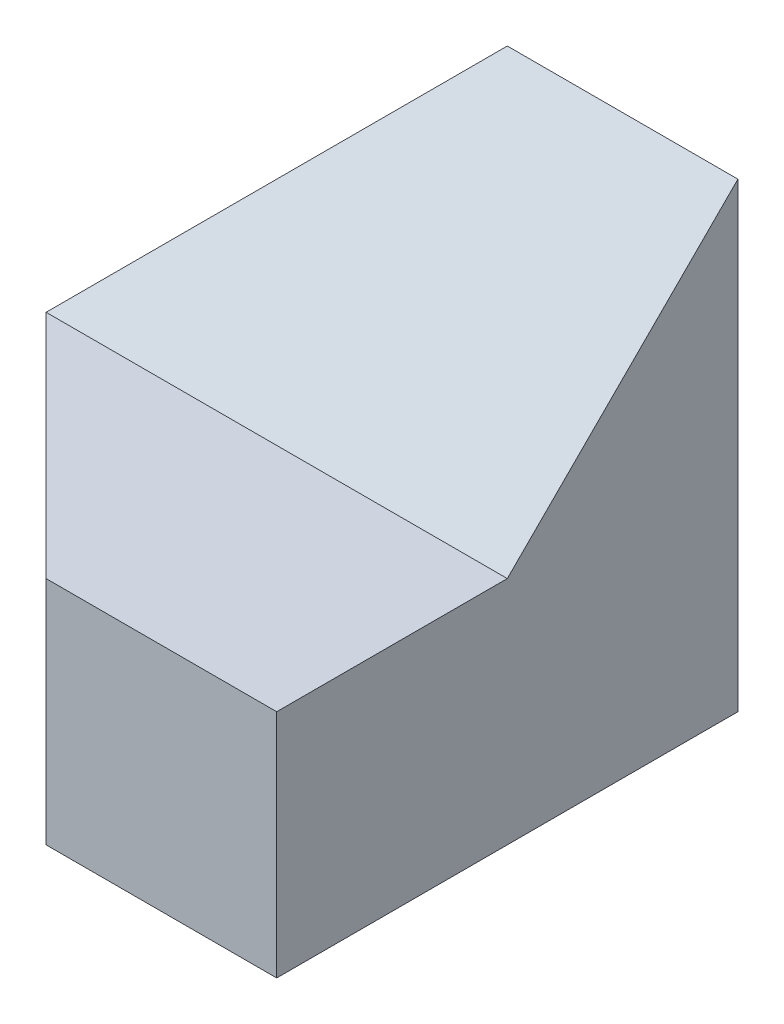
ISO-10303-21;
HEADER;
FILE_DESCRIPTION(('STEP AP214'),'2;1');
FILE_NAME('part.step','',(''),(''),'','','');
FILE_SCHEMA(('AUTOMOTIVE_DESIGN { 1 0 10303 214 1 1 1 1 }'));
ENDSEC;
DATA;
#1=APPLICATION_CONTEXT('core data for automotive mechanical design processes');
#2=APPLICATION_PROTOCOL_DEFINITION('international standard','automotive_design',2000,#1);
#3=PRODUCT_CONTEXT('',#1,'mechanical');
#4=PRODUCT('Part','Part','',(#3));
#5=PRODUCT_RELATED_PRODUCT_CATEGORY('part','',(#4));
#6=PRODUCT_DEFINITION_FORMATION('','',#4);
#7=PRODUCT_DEFINITION_CONTEXT('part definition',#1,'design');
#8=PRODUCT_DEFINITION('design','',#6,#7);
#9=PRODUCT_DEFINITION_SHAPE('','',#8);
#10=(LENGTH_UNIT() NAMED_UNIT(*) SI_UNIT(.MILLI.,.METRE.));
#11=(NAMED_UNIT(*) PLANE_ANGLE_UNIT() SI_UNIT($,.RADIAN.));
#12=(NAMED_UNIT(*) SI_UNIT($,.STERADIAN.) SOLID_ANGLE_UNIT());
#13=UNCERTAINTY_MEASURE_WITH_UNIT(LENGTH_MEASURE(1.E-05),#10,'distance_accuracy_value','');
#14=(GEOMETRIC_REPRESENTATION_CONTEXT(3) GLOBAL_UNCERTAINTY_ASSIGNED_CONTEXT((#13)) GLOBAL_UNIT_ASSIGNED_CONTEXT((#10,
#11,#12)) REPRESENTATION_CONTEXT('',''));
#15=CARTESIAN_POINT('',(0.,0.,0.));
#16=DIRECTION('',(0.,0.,1.));
#17=DIRECTION('',(1.,0.,0.));
#18=AXIS2_PLACEMENT_3D('',#15,#16,#17);
#19=CARTESIAN_POINT('',(0.,0.,40.));
#20=DIRECTION('',(1.,0.,0.));
#21=DIRECTION('',(0.,0.,-1.));
#22=AXIS2_PLACEMENT_3D('',#19,#20,#21);
#23=PLANE('',#22);
#24=DIRECTION('',(0.,0.,-1.));
#25=VECTOR('',#24,1.);
#26=CARTESIAN_POINT('',(0.,0.,40.));
#27=LINE('',#26,#25);
#28=CARTESIAN_POINT('',(0.,0.,20.));
#29=VERTEX_POINT('',#28);
#30=CARTESIAN_POINT('',(0.,0.,0.));
#31=VERTEX_POINT('',#30);
#32=EDGE_CURVE('E40',#29,#31,#27,.T.);
#33=ORIENTED_EDGE('',*,*,#32,.F.);
#34=DIRECTION('',(0.,1.,0.));
#35=VECTOR('',#34,1.);
#36=CARTESIAN_POINT('',(0.,-20.,20.));
#37=LINE('',#36,#35);
#38=CARTESIAN_POINT('',(0.,20.,20.));
#39=VERTEX_POINT('',#38);
#40=EDGE_CURVE('E99',#29,#39,#37,.T.);
#41=ORIENTED_EDGE('',*,*,#40,.T.);
#42=DIRECTION('',(0.,0.,1.));
#43=VECTOR('',#42,1.);
#44=CARTESIAN_POINT('',(0.,20.,0.));
#45=LINE('',#44,#43);
#46=CARTESIAN_POINT('',(0.,20.,0.));
#47=VERTEX_POINT('',#46);
#48=EDGE_CURVE('E105',#47,#39,#45,.T.);
#49=ORIENTED_EDGE('',*,*,#48,.F.);
#50=DIRECTION('',(0.,-1.,0.));
#51=VECTOR('',#50,1.);
#52=CARTESIAN_POINT('',(0.,0.,0.));
#53=LINE('',#52,#51);
#54=EDGE_CURVE('E119',#47,#31,#53,.T.);
#55=ORIENTED_EDGE('',*,*,#54,.T.);
#56=EDGE_LOOP('',(#33,#41,#49,#55));
#57=FACE_BOUND('',#56,.T.);
#58=ADVANCED_FACE('F33',(#57),#23,.F.);
#59=CARTESIAN_POINT('',(0.,0.,40.));
#60=DIRECTION('',(0.,1.,0.));
#61=DIRECTION('',(0.,0.,1.));
#62=AXIS2_PLACEMENT_3D('',#59,#60,#61);
#63=PLANE('',#62);
#64=DIRECTION('',(1.,0.,0.));
#65=VECTOR('',#64,1.);
#66=CARTESIAN_POINT('',(0.,0.,40.));
#67=LINE('',#66,#65);
#68=CARTESIAN_POINT('',(20.,0.,40.));
#69=VERTEX_POINT('',#68);
#70=CARTESIAN_POINT('',(40.,0.,40.));
#71=VERTEX_POINT('',#70);
#72=EDGE_CURVE('E55',#69,#71,#67,.T.);
#73=ORIENTED_EDGE('',*,*,#72,.F.);
#74=DIRECTION('',(-0.707106781186548,0.,-0.707106781186548));
#75=VECTOR('',#74,1.);
#76=CARTESIAN_POINT('',(10.,0.,30.));
#77=LINE('',#76,#75);
#78=EDGE_CURVE('E107',#69,#29,#77,.T.);
#79=ORIENTED_EDGE('',*,*,#78,.T.);
#80=ORIENTED_EDGE('',*,*,#32,.T.);
#81=DIRECTION('',(1.,0.,0.));
#82=VECTOR('',#81,1.);
#83=CARTESIAN_POINT('',(0.,0.,0.));
#84=LINE('',#83,#82);
#85=CARTESIAN_POINT('',(40.,0.,0.));
#86=VERTEX_POINT('',#85);
#87=EDGE_CURVE('E121',#31,#86,#84,.T.);
#88=ORIENTED_EDGE('',*,*,#87,.T.);
#89=DIRECTION('',(0.,0.,-1.));
#90=VECTOR('',#89,1.);
#91=CARTESIAN_POINT('',(40.,0.,40.));
#92=LINE('',#91,#90);
#93=EDGE_CURVE('E127',#71,#86,#92,.T.);
#94=ORIENTED_EDGE('',*,*,#93,.F.);
#95=EDGE_LOOP('',(#73,#79,#80,#88,#94));
#96=FACE_BOUND('',#95,.T.);
#97=ADVANCED_FACE('F142',(#96),#63,.F.);
#98=CARTESIAN_POINT('',(40.,0.,40.));
#99=DIRECTION('',(-1.,0.,0.));
#100=DIRECTION('',(0.,0.,1.));
#101=AXIS2_PLACEMENT_3D('',#98,#99,#100);
#102=PLANE('',#101);
#103=DIRECTION('',(0.,-0.707106781186538,0.707106781186557));
#104=VECTOR('',#103,1.);
#105=CARTESIAN_POINT('',(40.,20.,20.));
#106=LINE('',#105,#104);
#107=CARTESIAN_POINT('',(40.,39.9999999999995,0.));
#108=VERTEX_POINT('',#107);
#109=CARTESIAN_POINT('',(40.,20.,20.));
#110=VERTEX_POINT('',#109);
#111=EDGE_CURVE('E217',#108,#110,#106,.T.);
#112=ORIENTED_EDGE('',*,*,#111,.T.);
#113=DIRECTION('',(0.,0.,1.));
#114=VECTOR('',#113,1.);
#115=CARTESIAN_POINT('',(40.,20.,40.));
#116=LINE('',#115,#114);
#117=CARTESIAN_POINT('',(40.,20.,40.));
#118=VERTEX_POINT('',#117);
#119=EDGE_CURVE('E113',#110,#118,#116,.T.);
#120=ORIENTED_EDGE('',*,*,#119,.T.);
#121=DIRECTION('',(0.,1.,0.));
#122=VECTOR('',#121,1.);
#123=CARTESIAN_POINT('',(40.,0.,40.));
#124=LINE('',#123,#122);
#125=EDGE_CURVE('E126',#71,#118,#124,.T.);
#126=ORIENTED_EDGE('',*,*,#125,.F.);
#127=ORIENTED_EDGE('',*,*,#93,.T.);
#128=DIRECTION('',(0.,1.,0.));
#129=VECTOR('',#128,1.);
#130=CARTESIAN_POINT('',(40.,0.,0.));
#131=LINE('',#130,#129);
#132=EDGE_CURVE('E130',#86,#108,#131,.T.);
#133=ORIENTED_EDGE('',*,*,#132,.T.);
#134=EDGE_LOOP('',(#112,#120,#126,#127,#133));
#135=FACE_BOUND('',#134,.T.);
#136=ADVANCED_FACE('F138',(#135),#102,.F.);
#137=CARTESIAN_POINT('',(0.,0.,40.));
#138=DIRECTION('',(0.,0.,-1.));
#139=DIRECTION('',(-1.,0.,0.));
#140=AXIS2_PLACEMENT_3D('',#137,#138,#139);
#141=PLANE('',#140);
#142=DIRECTION('',(-1.,0.,0.));
#143=VECTOR('',#142,1.);
#144=CARTESIAN_POINT('',(40.,20.,40.));
#145=LINE('',#144,#143);
#146=CARTESIAN_POINT('',(20.,20.,40.));
#147=VERTEX_POINT('',#146);
#148=EDGE_CURVE('E115',#118,#147,#145,.T.);
#149=ORIENTED_EDGE('',*,*,#148,.T.);
#150=DIRECTION('',(0.,1.,0.));
#151=VECTOR('',#150,1.);
#152=CARTESIAN_POINT('',(20.,-20.,40.));
#153=LINE('',#152,#151);
#154=EDGE_CURVE('E47',#69,#147,#153,.T.);
#155=ORIENTED_EDGE('',*,*,#154,.F.);
#156=ORIENTED_EDGE('',*,*,#72,.T.);
#157=ORIENTED_EDGE('',*,*,#125,.T.);
#158=EDGE_LOOP('',(#149,#155,#156,#157));
#159=FACE_BOUND('',#158,.T.);
#160=ADVANCED_FACE('F148',(#159),#141,.F.);
#161=CARTESIAN_POINT('',(0.,0.,0.));
#162=DIRECTION('',(0.,0.,-1.));
#163=DIRECTION('',(-1.,0.,0.));
#164=AXIS2_PLACEMENT_3D('',#161,#162,#163);
#165=PLANE('',#164);
#166=DIRECTION('',(0.707106781186548,0.707106781186548,0.));
#167=VECTOR('',#166,1.);
#168=CARTESIAN_POINT('',(20.,40.,0.));
#169=LINE('',#168,#167);
#170=CARTESIAN_POINT('',(19.9999999999996,39.9999999999995,0.));
#171=VERTEX_POINT('',#170);
#172=EDGE_CURVE('E73',#47,#171,#169,.T.);
#173=ORIENTED_EDGE('',*,*,#172,.T.);
#174=DIRECTION('',(-1.,0.,0.));
#175=VECTOR('',#174,1.);
#176=CARTESIAN_POINT('',(0.,40.,0.));
#177=LINE('',#176,#175);
#178=EDGE_CURVE('E81',#108,#171,#177,.T.);
#179=ORIENTED_EDGE('',*,*,#178,.F.);
#180=ORIENTED_EDGE('',*,*,#132,.F.);
#181=ORIENTED_EDGE('',*,*,#87,.F.);
#182=ORIENTED_EDGE('',*,*,#54,.F.);
#183=EDGE_LOOP('',(#173,#179,#180,#181,#182));
#184=FACE_BOUND('',#183,.T.);
#185=ADVANCED_FACE('F141',(#184),#165,.T.);
#186=CARTESIAN_POINT('',(20.,40.,0.));
#187=DIRECTION('',(0.707106781186548,-0.707106781186548,0.));
#188=DIRECTION('',(0.707106781186548,0.707106781186548,0.));
#189=AXIS2_PLACEMENT_3D('',#186,#187,#188);
#190=PLANE('',#189);
#191=ORIENTED_EDGE('',*,*,#48,.T.);
#192=DIRECTION('',(0.577350269189621,0.577350269189621,-0.577350269189636));
#193=VECTOR('',#192,1.);
#194=CARTESIAN_POINT('',(19.9999999999998,39.9999999999998,-3.48364264270461E-13));
#195=LINE('',#194,#193);
#196=EDGE_CURVE('E11',#39,#171,#195,.T.);
#197=ORIENTED_EDGE('',*,*,#196,.T.);
#198=ORIENTED_EDGE('',*,*,#172,.F.);
#199=EDGE_LOOP('',(#191,#197,#198));
#200=FACE_BOUND('',#199,.T.);
#201=ADVANCED_FACE('F118',(#200),#190,.F.);
#202=CARTESIAN_POINT('',(40.,20.,20.));
#203=DIRECTION('',(0.,-0.707106781186557,-0.707106781186538));
#204=DIRECTION('',(0.,0.707106781186538,-0.707106781186557));
#205=AXIS2_PLACEMENT_3D('',#202,#203,#204);
#206=PLANE('',#205);
#207=DIRECTION('',(-1.,0.,0.));
#208=VECTOR('',#207,1.);
#209=CARTESIAN_POINT('',(40.,20.,20.));
#210=LINE('',#209,#208);
#211=EDGE_CURVE('E110',#110,#39,#210,.T.);
#212=ORIENTED_EDGE('',*,*,#211,.F.);
#213=ORIENTED_EDGE('',*,*,#111,.F.);
#214=ORIENTED_EDGE('',*,*,#178,.T.);
#215=ORIENTED_EDGE('',*,*,#196,.F.);
#216=EDGE_LOOP('',(#212,#213,#214,#215));
#217=FACE_BOUND('',#216,.T.);
#218=ADVANCED_FACE('F117',(#217),#206,.F.);
#219=CARTESIAN_POINT('',(40.,20.,40.));
#220=DIRECTION('',(0.,-1.,0.));
#221=DIRECTION('',(0.,0.,-1.));
#222=AXIS2_PLACEMENT_3D('',#219,#220,#221);
#223=PLANE('',#222);
#224=ORIENTED_EDGE('',*,*,#211,.T.);
#225=DIRECTION('',(-0.707106781186548,0.,-0.707106781186548));
#226=VECTOR('',#225,1.);
#227=CARTESIAN_POINT('',(0.,20.,20.));
#228=LINE('',#227,#226);
#229=EDGE_CURVE('E96',#147,#39,#228,.T.);
#230=ORIENTED_EDGE('',*,*,#229,.F.);
#231=ORIENTED_EDGE('',*,*,#148,.F.);
#232=ORIENTED_EDGE('',*,*,#119,.F.);
#233=EDGE_LOOP('',(#224,#230,#231,#232));
#234=FACE_BOUND('',#233,.T.);
#235=ADVANCED_FACE('F111',(#234),#223,.F.);
#236=CARTESIAN_POINT('',(0.,-20.,20.));
#237=DIRECTION('',(0.707106781186548,0.,-0.707106781186548));
#238=DIRECTION('',(-0.707106781186548,0.,-0.707106781186548));
#239=AXIS2_PLACEMENT_3D('',#236,#237,#238);
#240=PLANE('',#239);
#241=ORIENTED_EDGE('',*,*,#154,.T.);
#242=ORIENTED_EDGE('',*,*,#229,.T.);
#243=ORIENTED_EDGE('',*,*,#40,.F.);
#244=ORIENTED_EDGE('',*,*,#78,.F.);
#245=EDGE_LOOP('',(#241,#242,#243,#244));
#246=FACE_BOUND('',#245,.T.);
#247=ADVANCED_FACE('F98',(#246),#240,.F.);
#248=CLOSED_SHELL('',(#58,#97,#136,#160,#185,#201,#218,#235,#247));
#249=MANIFOLD_SOLID_BREP('B2',#248);
#250=ADVANCED_BREP_SHAPE_REPRESENTATION('',(#18,#249),#14);
#251=SHAPE_DEFINITION_REPRESENTATION(#9,#250);
ENDSEC;
END-ISO-10303-21;
